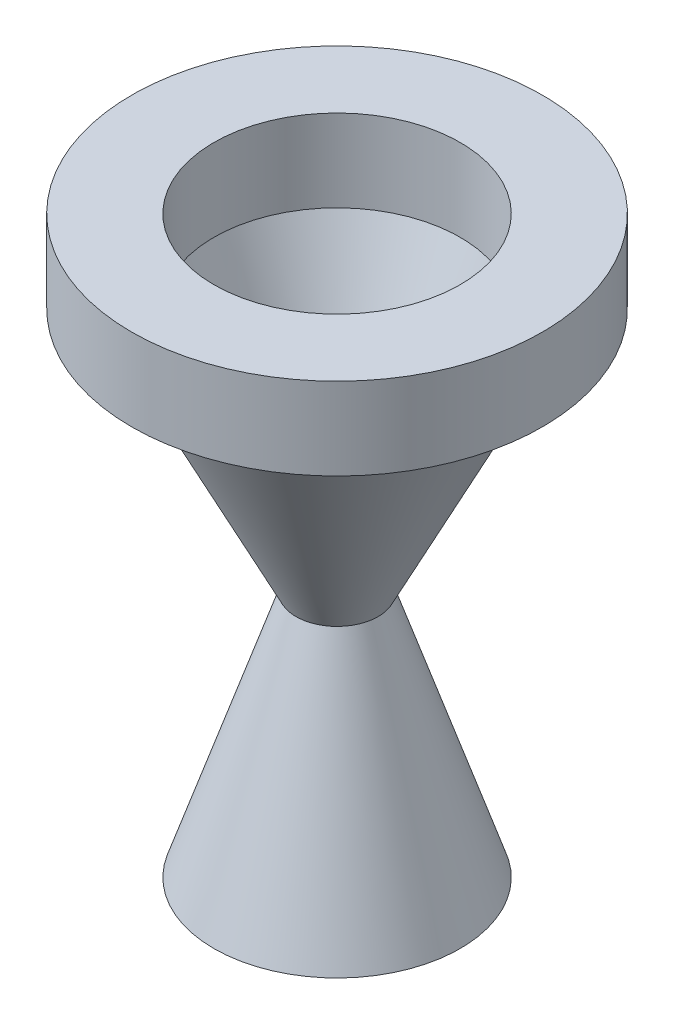
ISO-10303-21;
HEADER;
FILE_DESCRIPTION(('STEP AP214'),'2;1');
FILE_NAME('part.step','',(''),(''),'','','');
FILE_SCHEMA(('AUTOMOTIVE_DESIGN { 1 0 10303 214 1 1 1 1 }'));
ENDSEC;
DATA;
#1=APPLICATION_CONTEXT('core data for automotive mechanical design processes');
#2=APPLICATION_PROTOCOL_DEFINITION('international standard','automotive_design',2000,#1);
#3=PRODUCT_CONTEXT('',#1,'mechanical');
#4=PRODUCT('Part','Part','',(#3));
#5=PRODUCT_RELATED_PRODUCT_CATEGORY('part','',(#4));
#6=PRODUCT_DEFINITION_FORMATION('','',#4);
#7=PRODUCT_DEFINITION_CONTEXT('part definition',#1,'design');
#8=PRODUCT_DEFINITION('design','',#6,#7);
#9=PRODUCT_DEFINITION_SHAPE('','',#8);
#10=(LENGTH_UNIT() NAMED_UNIT(*) SI_UNIT(.MILLI.,.METRE.));
#11=(NAMED_UNIT(*) PLANE_ANGLE_UNIT() SI_UNIT($,.RADIAN.));
#12=(NAMED_UNIT(*) SI_UNIT($,.STERADIAN.) SOLID_ANGLE_UNIT());
#13=UNCERTAINTY_MEASURE_WITH_UNIT(LENGTH_MEASURE(1.E-05),#10,'distance_accuracy_value','');
#14=(GEOMETRIC_REPRESENTATION_CONTEXT(3) GLOBAL_UNCERTAINTY_ASSIGNED_CONTEXT((#13)) GLOBAL_UNIT_ASSIGNED_CONTEXT((#10,
#11,#12)) REPRESENTATION_CONTEXT('',''));
#15=CARTESIAN_POINT('',(0.,0.,0.));
#16=DIRECTION('',(0.,0.,1.));
#17=DIRECTION('',(1.,0.,0.));
#18=AXIS2_PLACEMENT_3D('',#15,#16,#17);
#19=CARTESIAN_POINT('',(0.,25.4,0.));
#20=DIRECTION('',(0.,1.,0.));
#21=DIRECTION('',(0.,0.,1.));
#22=AXIS2_PLACEMENT_3D('',#19,#20,#21);
#23=PLANE('',#22);
#24=CARTESIAN_POINT('',(0.,25.4,0.));
#25=DIRECTION('',(0.,1.,0.));
#26=DIRECTION('',(0.,0.,1.));
#27=AXIS2_PLACEMENT_3D('',#24,#25,#26);
#28=CIRCLE('',#27,63.5);
#29=CARTESIAN_POINT('',(0.,25.4,63.5));
#30=VERTEX_POINT('',#29);
#31=EDGE_CURVE('E42',#30,#30,#28,.T.);
#32=ORIENTED_EDGE('',*,*,#31,.T.);
#33=EDGE_LOOP('',(#32));
#34=FACE_BOUND('',#33,.T.);
#35=CARTESIAN_POINT('',(0.,25.4,0.));
#36=DIRECTION('',(0.,1.,0.));
#37=DIRECTION('',(0.,0.,1.));
#38=AXIS2_PLACEMENT_3D('',#35,#36,#37);
#39=CIRCLE('',#38,38.1);
#40=CARTESIAN_POINT('',(0.,25.4,38.1));
#41=VERTEX_POINT('',#40);
#42=EDGE_CURVE('E50',#41,#41,#39,.T.);
#43=ORIENTED_EDGE('',*,*,#42,.F.);
#44=EDGE_LOOP('',(#43));
#45=FACE_BOUND('',#44,.T.);
#46=ADVANCED_FACE('F31',(#34,#45),#23,.T.);
#47=CARTESIAN_POINT('',(0.,0.,0.));
#48=DIRECTION('',(0.,1.,0.));
#49=DIRECTION('',(0.,0.,1.));
#50=AXIS2_PLACEMENT_3D('',#47,#48,#49);
#51=PLANE('',#50);
#52=CARTESIAN_POINT('',(0.,0.,0.));
#53=DIRECTION('',(0.,-1.,0.));
#54=DIRECTION('',(0.,0.,-1.));
#55=AXIS2_PLACEMENT_3D('',#52,#53,#54);
#56=CIRCLE('',#55,50.8);
#57=CARTESIAN_POINT('',(0.,0.,-50.8));
#58=VERTEX_POINT('',#57);
#59=EDGE_CURVE('E60',#58,#58,#56,.T.);
#60=ORIENTED_EDGE('',*,*,#59,.F.);
#61=EDGE_LOOP('',(#60));
#62=FACE_BOUND('',#61,.T.);
#63=CARTESIAN_POINT('',(0.,0.,0.));
#64=DIRECTION('',(0.,1.,0.));
#65=DIRECTION('',(0.,0.,1.));
#66=AXIS2_PLACEMENT_3D('',#63,#64,#65);
#67=CIRCLE('',#66,63.5);
#68=CARTESIAN_POINT('',(0.,0.,63.5));
#69=VERTEX_POINT('',#68);
#70=EDGE_CURVE('E46',#69,#69,#67,.T.);
#71=ORIENTED_EDGE('',*,*,#70,.F.);
#72=EDGE_LOOP('',(#71));
#73=FACE_BOUND('',#72,.T.);
#74=ADVANCED_FACE('F89',(#62,#73),#51,.F.);
#75=CARTESIAN_POINT('',(0.,25.4,0.));
#76=DIRECTION('',(0.,-1.,0.));
#77=DIRECTION('',(0.,0.,-1.));
#78=AXIS2_PLACEMENT_3D('',#75,#76,#77);
#79=CYLINDRICAL_SURFACE('',#78,63.5);
#80=ORIENTED_EDGE('',*,*,#31,.F.);
#81=EDGE_LOOP('',(#80));
#82=FACE_BOUND('',#81,.T.);
#83=ORIENTED_EDGE('',*,*,#70,.T.);
#84=EDGE_LOOP('',(#83));
#85=FACE_BOUND('',#84,.T.);
#86=ADVANCED_FACE('F96',(#82,#85),#79,.T.);
#87=CARTESIAN_POINT('',(0.,25.4,0.));
#88=DIRECTION('',(0.,-1.,0.));
#89=DIRECTION('',(0.,0.,-1.));
#90=AXIS2_PLACEMENT_3D('',#87,#88,#89);
#91=CYLINDRICAL_SURFACE('',#90,38.1);
#92=ORIENTED_EDGE('',*,*,#42,.T.);
#93=EDGE_LOOP('',(#92));
#94=FACE_BOUND('',#93,.T.);
#95=CARTESIAN_POINT('',(0.,0.,0.));
#96=DIRECTION('',(0.,1.,0.));
#97=DIRECTION('',(0.,0.,1.));
#98=AXIS2_PLACEMENT_3D('',#95,#96,#97);
#99=CIRCLE('',#98,38.1);
#100=CARTESIAN_POINT('',(0.,0.,38.1));
#101=VERTEX_POINT('',#100);
#102=EDGE_CURVE('E52',#101,#101,#99,.T.);
#103=ORIENTED_EDGE('',*,*,#102,.F.);
#104=EDGE_LOOP('',(#103));
#105=FACE_BOUND('',#104,.T.);
#106=ADVANCED_FACE('F101',(#94,#105),#91,.F.);
#107=CARTESIAN_POINT('',(0.,0.,0.));
#108=DIRECTION('',(0.,1.,0.));
#109=DIRECTION('',(0.,0.,1.));
#110=AXIS2_PLACEMENT_3D('',#107,#108,#109);
#111=CONICAL_SURFACE('',#110,38.1,0.394791119699761);
#112=CARTESIAN_POINT('',(0.,-74.6466376293522,0.));
#113=DIRECTION('',(0.,1.,0.));
#114=DIRECTION('',(0.,0.,1.));
#115=AXIS2_PLACEMENT_3D('',#112,#113,#114);
#116=CIRCLE('',#115,6.99723432110326);
#117=CARTESIAN_POINT('',(0.,-74.6466376293522,6.99723432110326));
#118=VERTEX_POINT('',#117);
#119=EDGE_CURVE('E10',#118,#118,#116,.F.);
#120=ORIENTED_EDGE('',*,*,#119,.T.);
#121=EDGE_LOOP('',(#120));
#122=FACE_BOUND('',#121,.T.);
#123=ORIENTED_EDGE('',*,*,#102,.T.);
#124=EDGE_LOOP('',(#123));
#125=FACE_BOUND('',#124,.T.);
#126=ADVANCED_FACE('F85',(#122,#125),#111,.F.);
#127=CARTESIAN_POINT('',(0.,-76.2,0.));
#128=DIRECTION('',(0.,1.,0.));
#129=DIRECTION('',(0.,0.,1.));
#130=AXIS2_PLACEMENT_3D('',#127,#128,#129);
#131=CONICAL_SURFACE('',#130,12.7,0.463647609000806);
#132=ORIENTED_EDGE('',*,*,#59,.T.);
#133=EDGE_LOOP('',(#132));
#134=FACE_BOUND('',#133,.T.);
#135=CARTESIAN_POINT('',(0.,-76.2,0.));
#136=DIRECTION('',(0.,-1.,0.));
#137=DIRECTION('',(0.,0.,-1.));
#138=AXIS2_PLACEMENT_3D('',#135,#136,#137);
#139=CIRCLE('',#138,12.7);
#140=CARTESIAN_POINT('',(0.,-76.2,-12.7));
#141=VERTEX_POINT('',#140);
#142=EDGE_CURVE('E55',#141,#141,#139,.T.);
#143=ORIENTED_EDGE('',*,*,#142,.F.);
#144=EDGE_LOOP('',(#143));
#145=FACE_BOUND('',#144,.T.);
#146=ADVANCED_FACE('F80',(#134,#145),#131,.T.);
#147=CARTESIAN_POINT('',(0.,-76.2,0.));
#148=DIRECTION('',(0.,-1.,0.));
#149=DIRECTION('',(0.,0.,-1.));
#150=AXIS2_PLACEMENT_3D('',#147,#148,#149);
#151=CONICAL_SURFACE('',#150,6.35,0.244978663126864);
#152=CARTESIAN_POINT('',(0.,-77.8325647583829,0.));
#153=DIRECTION('',(0.,-1.,0.));
#154=DIRECTION('',(0.,0.,-1.));
#155=AXIS2_PLACEMENT_3D('',#152,#153,#154);
#156=CIRCLE('',#155,6.75814118959573);
#157=CARTESIAN_POINT('',(0.,-77.8325647583829,-6.75814118959573));
#158=VERTEX_POINT('',#157);
#159=EDGE_CURVE('E38',#158,#158,#156,.F.);
#160=ORIENTED_EDGE('',*,*,#159,.T.);
#161=EDGE_LOOP('',(#160));
#162=FACE_BOUND('',#161,.T.);
#163=CARTESIAN_POINT('',(0.,-152.4,0.));
#164=DIRECTION('',(0.,1.,0.));
#165=DIRECTION('',(0.,0.,1.));
#166=AXIS2_PLACEMENT_3D('',#163,#164,#165);
#167=CIRCLE('',#166,25.4);
#168=CARTESIAN_POINT('',(0.,-152.4,25.4));
#169=VERTEX_POINT('',#168);
#170=EDGE_CURVE('E63',#169,#169,#167,.T.);
#171=ORIENTED_EDGE('',*,*,#170,.F.);
#172=EDGE_LOOP('',(#171));
#173=FACE_BOUND('',#172,.T.);
#174=ADVANCED_FACE('F75',(#162,#173),#151,.F.);
#175=CARTESIAN_POINT('',(25.4,-152.4,0.));
#176=DIRECTION('',(0.,1.,0.));
#177=DIRECTION('',(0.,0.,1.));
#178=AXIS2_PLACEMENT_3D('',#175,#176,#177);
#179=PLANE('',#178);
#180=CARTESIAN_POINT('',(0.,-152.4,0.));
#181=DIRECTION('',(0.,1.,0.));
#182=DIRECTION('',(0.,0.,1.));
#183=AXIS2_PLACEMENT_3D('',#180,#181,#182);
#184=CIRCLE('',#183,38.1);
#185=CARTESIAN_POINT('',(0.,-152.4,38.1));
#186=VERTEX_POINT('',#185);
#187=EDGE_CURVE('E66',#186,#186,#184,.T.);
#188=ORIENTED_EDGE('',*,*,#187,.F.);
#189=EDGE_LOOP('',(#188));
#190=FACE_BOUND('',#189,.T.);
#191=ORIENTED_EDGE('',*,*,#170,.T.);
#192=EDGE_LOOP('',(#191));
#193=FACE_BOUND('',#192,.T.);
#194=ADVANCED_FACE('F72',(#190,#193),#179,.F.);
#195=CARTESIAN_POINT('',(0.,-152.4,0.));
#196=DIRECTION('',(0.,-1.,0.));
#197=DIRECTION('',(0.,0.,-1.));
#198=AXIS2_PLACEMENT_3D('',#195,#196,#197);
#199=CONICAL_SURFACE('',#198,38.1,0.321750554396642);
#200=ORIENTED_EDGE('',*,*,#142,.T.);
#201=EDGE_LOOP('',(#200));
#202=FACE_BOUND('',#201,.T.);
#203=ORIENTED_EDGE('',*,*,#187,.T.);
#204=EDGE_LOOP('',(#203));
#205=FACE_BOUND('',#204,.T.);
#206=ADVANCED_FACE('F70',(#202,#205),#199,.T.);
#207=CARTESIAN_POINT('',(0.,-76.6004837831984,0.));
#208=DIRECTION('',(0.,-1.,0.));
#209=DIRECTION('',(0.,0.,-1.));
#210=AXIS2_PLACEMENT_3D('',#207,#208,#209);
#211=TOROIDAL_SURFACE('',#210,11.686465090334,5.08);
#212=ORIENTED_EDGE('',*,*,#119,.F.);
#213=EDGE_LOOP('',(#212));
#214=FACE_BOUND('',#213,.T.);
#215=ORIENTED_EDGE('',*,*,#159,.F.);
#216=EDGE_LOOP('',(#215));
#217=FACE_BOUND('',#216,.T.);
#218=ADVANCED_FACE('F33',(#214,#217),#211,.T.);
#219=CLOSED_SHELL('',(#46,#74,#86,#106,#126,#146,#174,#194,#206,#218));
#220=MANIFOLD_SOLID_BREP('B2',#219);
#221=ADVANCED_BREP_SHAPE_REPRESENTATION('',(#18,#220),#14);
#222=SHAPE_DEFINITION_REPRESENTATION(#9,#221);
ENDSEC;
END-ISO-10303-21;
